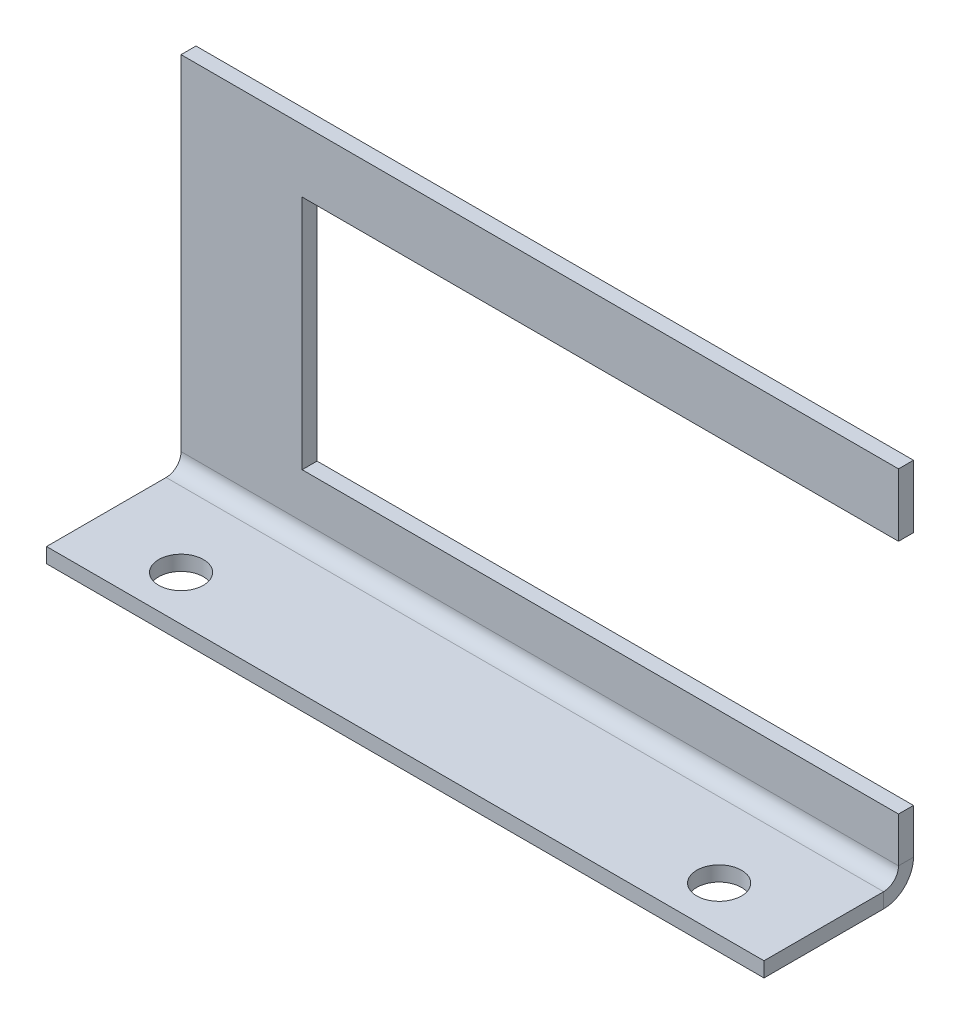
ISO-10303-21;
HEADER;
FILE_DESCRIPTION(('STEP AP214'),'2;1');
FILE_NAME('part.step','',(''),(''),'','','');
FILE_SCHEMA(('AUTOMOTIVE_DESIGN { 1 0 10303 214 1 1 1 1 }'));
ENDSEC;
DATA;
#1=APPLICATION_CONTEXT('core data for automotive mechanical design processes');
#2=APPLICATION_PROTOCOL_DEFINITION('international standard','automotive_design',2000,#1);
#3=PRODUCT_CONTEXT('',#1,'mechanical');
#4=PRODUCT('Part','Part','',(#3));
#5=PRODUCT_RELATED_PRODUCT_CATEGORY('part','',(#4));
#6=PRODUCT_DEFINITION_FORMATION('','',#4);
#7=PRODUCT_DEFINITION_CONTEXT('part definition',#1,'design');
#8=PRODUCT_DEFINITION('design','',#6,#7);
#9=PRODUCT_DEFINITION_SHAPE('','',#8);
#10=(LENGTH_UNIT() NAMED_UNIT(*) SI_UNIT(.MILLI.,.METRE.));
#11=(NAMED_UNIT(*) PLANE_ANGLE_UNIT() SI_UNIT($,.RADIAN.));
#12=(NAMED_UNIT(*) SI_UNIT($,.STERADIAN.) SOLID_ANGLE_UNIT());
#13=UNCERTAINTY_MEASURE_WITH_UNIT(LENGTH_MEASURE(1.E-05),#10,'distance_accuracy_value','');
#14=(GEOMETRIC_REPRESENTATION_CONTEXT(3) GLOBAL_UNCERTAINTY_ASSIGNED_CONTEXT((#13)) GLOBAL_UNIT_ASSIGNED_CONTEXT((#10,
#11,#12)) REPRESENTATION_CONTEXT('',''));
#15=CARTESIAN_POINT('',(0.,0.,0.));
#16=DIRECTION('',(0.,0.,1.));
#17=DIRECTION('',(1.,0.,0.));
#18=AXIS2_PLACEMENT_3D('',#15,#16,#17);
#19=CARTESIAN_POINT('',(60.96,1.27,-11.43));
#20=DIRECTION('',(1.,0.,0.));
#21=DIRECTION('',(0.,-1.,0.));
#22=AXIS2_PLACEMENT_3D('',#19,#20,#21);
#23=PLANE('',#22);
#24=DIRECTION('',(0.,-1.,0.));
#25=VECTOR('',#24,1.);
#26=CARTESIAN_POINT('',(60.96,1.27,-11.43));
#27=LINE('',#26,#25);
#28=CARTESIAN_POINT('',(60.96,31.75,-11.43));
#29=VERTEX_POINT('',#28);
#30=CARTESIAN_POINT('',(60.96,26.416,-11.43));
#31=VERTEX_POINT('',#30);
#32=EDGE_CURVE('E193',#29,#31,#27,.T.);
#33=ORIENTED_EDGE('',*,*,#32,.T.);
#34=DIRECTION('',(0.,0.,-1.));
#35=VECTOR('',#34,1.);
#36=CARTESIAN_POINT('',(60.96,26.416,-12.7));
#37=LINE('',#36,#35);
#38=CARTESIAN_POINT('',(60.96,26.416,-12.7));
#39=VERTEX_POINT('',#38);
#40=EDGE_CURVE('E294',#39,#31,#37,.F.);
#41=ORIENTED_EDGE('',*,*,#40,.F.);
#42=DIRECTION('',(0.,1.,0.));
#43=VECTOR('',#42,1.);
#44=CARTESIAN_POINT('',(60.96,1.27,-12.7));
#45=LINE('',#44,#43);
#46=CARTESIAN_POINT('',(60.96,31.75,-12.7));
#47=VERTEX_POINT('',#46);
#48=EDGE_CURVE('E135',#47,#39,#45,.F.);
#49=ORIENTED_EDGE('',*,*,#48,.F.);
#50=DIRECTION('',(0.,0.,1.));
#51=VECTOR('',#50,1.);
#52=CARTESIAN_POINT('',(60.96,31.75,-11.43));
#53=LINE('',#52,#51);
#54=EDGE_CURVE('E151',#47,#29,#53,.T.);
#55=ORIENTED_EDGE('',*,*,#54,.T.);
#56=EDGE_LOOP('',(#33,#41,#49,#55));
#57=FACE_BOUND('',#56,.T.);
#58=ADVANCED_FACE('F36',(#57),#23,.T.);
#59=CARTESIAN_POINT('',(60.96,6.35,-12.7));
#60=VERTEX_POINT('',#59);
#61=CARTESIAN_POINT('',(60.96,2.54,-12.7));
#62=VERTEX_POINT('',#61);
#63=EDGE_CURVE('E118',#60,#62,#45,.F.);
#64=ORIENTED_EDGE('',*,*,#63,.F.);
#65=DIRECTION('',(0.,0.,-1.));
#66=VECTOR('',#65,1.);
#67=CARTESIAN_POINT('',(60.96,6.35,-12.7));
#68=LINE('',#67,#66);
#69=CARTESIAN_POINT('',(60.96,6.35,-11.43));
#70=VERTEX_POINT('',#69);
#71=EDGE_CURVE('E299',#60,#70,#68,.F.);
#72=ORIENTED_EDGE('',*,*,#71,.T.);
#73=CARTESIAN_POINT('',(60.96,2.54,-11.43));
#74=VERTEX_POINT('',#73);
#75=EDGE_CURVE('E61',#70,#74,#27,.T.);
#76=ORIENTED_EDGE('',*,*,#75,.T.);
#77=DIRECTION('',(0.,0.,1.));
#78=VECTOR('',#77,1.);
#79=CARTESIAN_POINT('',(60.96,2.54,-11.43));
#80=LINE('',#79,#78);
#81=EDGE_CURVE('E154',#62,#74,#80,.T.);
#82=ORIENTED_EDGE('',*,*,#81,.F.);
#83=EDGE_LOOP('',(#64,#72,#76,#82));
#84=FACE_BOUND('',#83,.T.);
#85=ADVANCED_FACE('F242',(#84),#23,.T.);
#86=CARTESIAN_POINT('',(60.96,1.27,-11.43));
#87=DIRECTION('',(0.,0.,-1.));
#88=DIRECTION('',(-1.,0.,0.));
#89=AXIS2_PLACEMENT_3D('',#86,#87,#88);
#90=PLANE('',#89);
#91=DIRECTION('',(-1.,0.,0.));
#92=VECTOR('',#91,1.);
#93=CARTESIAN_POINT('',(10.287,26.416,-11.43));
#94=LINE('',#93,#92);
#95=CARTESIAN_POINT('',(10.287,26.416,-11.43));
#96=VERTEX_POINT('',#95);
#97=EDGE_CURVE('E312',#31,#96,#94,.T.);
#98=ORIENTED_EDGE('',*,*,#97,.F.);
#99=ORIENTED_EDGE('',*,*,#32,.F.);
#100=DIRECTION('',(-1.,0.,0.));
#101=VECTOR('',#100,1.);
#102=CARTESIAN_POINT('',(60.96,31.75,-11.43));
#103=LINE('',#102,#101);
#104=CARTESIAN_POINT('',(0.,31.75,-11.43));
#105=VERTEX_POINT('',#104);
#106=EDGE_CURVE('E196',#29,#105,#103,.T.);
#107=ORIENTED_EDGE('',*,*,#106,.T.);
#108=DIRECTION('',(0.,-1.,0.));
#109=VECTOR('',#108,1.);
#110=CARTESIAN_POINT('',(0.,1.27,-11.43));
#111=LINE('',#110,#109);
#112=CARTESIAN_POINT('',(0.,2.54,-11.43));
#113=VERTEX_POINT('',#112);
#114=EDGE_CURVE('E188',#105,#113,#111,.T.);
#115=ORIENTED_EDGE('',*,*,#114,.T.);
#116=DIRECTION('',(-1.,0.,0.));
#117=VECTOR('',#116,1.);
#118=CARTESIAN_POINT('',(60.96,2.54,-11.43));
#119=LINE('',#118,#117);
#120=EDGE_CURVE('E106',#113,#74,#119,.F.);
#121=ORIENTED_EDGE('',*,*,#120,.T.);
#122=ORIENTED_EDGE('',*,*,#75,.F.);
#123=DIRECTION('',(1.,0.,0.));
#124=VECTOR('',#123,1.);
#125=CARTESIAN_POINT('',(10.287,6.35,-11.43));
#126=LINE('',#125,#124);
#127=CARTESIAN_POINT('',(10.287,6.35,-11.43));
#128=VERTEX_POINT('',#127);
#129=EDGE_CURVE('E319',#128,#70,#126,.T.);
#130=ORIENTED_EDGE('',*,*,#129,.F.);
#131=DIRECTION('',(0.,-1.,0.));
#132=VECTOR('',#131,1.);
#133=CARTESIAN_POINT('',(10.287,26.416,-11.43));
#134=LINE('',#133,#132);
#135=EDGE_CURVE('E52',#96,#128,#134,.T.);
#136=ORIENTED_EDGE('',*,*,#135,.F.);
#137=EDGE_LOOP('',(#98,#99,#107,#115,#121,#122,#130,#136));
#138=FACE_BOUND('',#137,.T.);
#139=ADVANCED_FACE('F210',(#138),#90,.F.);
#140=CARTESIAN_POINT('',(60.96,1.27,-12.7));
#141=DIRECTION('',(0.,0.,-1.));
#142=DIRECTION('',(-1.,0.,0.));
#143=AXIS2_PLACEMENT_3D('',#140,#141,#142);
#144=PLANE('',#143);
#145=ORIENTED_EDGE('',*,*,#48,.T.);
#146=DIRECTION('',(-1.,0.,0.));
#147=VECTOR('',#146,1.);
#148=CARTESIAN_POINT('',(10.287,26.416,-12.7));
#149=LINE('',#148,#147);
#150=CARTESIAN_POINT('',(10.287,26.416,-12.7));
#151=VERTEX_POINT('',#150);
#152=EDGE_CURVE('E314',#39,#151,#149,.T.);
#153=ORIENTED_EDGE('',*,*,#152,.T.);
#154=DIRECTION('',(0.,-1.,0.));
#155=VECTOR('',#154,1.);
#156=CARTESIAN_POINT('',(10.287,26.416,-12.7));
#157=LINE('',#156,#155);
#158=CARTESIAN_POINT('',(10.287,6.35,-12.7));
#159=VERTEX_POINT('',#158);
#160=EDGE_CURVE('E308',#151,#159,#157,.T.);
#161=ORIENTED_EDGE('',*,*,#160,.T.);
#162=DIRECTION('',(1.,0.,0.));
#163=VECTOR('',#162,1.);
#164=CARTESIAN_POINT('',(10.287,6.35,-12.7));
#165=LINE('',#164,#163);
#166=EDGE_CURVE('E311',#159,#60,#165,.T.);
#167=ORIENTED_EDGE('',*,*,#166,.T.);
#168=ORIENTED_EDGE('',*,*,#63,.T.);
#169=DIRECTION('',(-1.,0.,0.));
#170=VECTOR('',#169,1.);
#171=CARTESIAN_POINT('',(60.96,2.54,-12.7));
#172=LINE('',#171,#170);
#173=CARTESIAN_POINT('',(0.,2.54,-12.7));
#174=VERTEX_POINT('',#173);
#175=EDGE_CURVE('E110',#174,#62,#172,.F.);
#176=ORIENTED_EDGE('',*,*,#175,.F.);
#177=DIRECTION('',(0.,1.,0.));
#178=VECTOR('',#177,1.);
#179=CARTESIAN_POINT('',(0.,1.27,-12.7));
#180=LINE('',#179,#178);
#181=CARTESIAN_POINT('',(0.,31.75,-12.7));
#182=VERTEX_POINT('',#181);
#183=EDGE_CURVE('E114',#182,#174,#180,.F.);
#184=ORIENTED_EDGE('',*,*,#183,.F.);
#185=DIRECTION('',(-1.,0.,0.));
#186=VECTOR('',#185,1.);
#187=CARTESIAN_POINT('',(60.96,31.75,-12.7));
#188=LINE('',#187,#186);
#189=EDGE_CURVE('E142',#47,#182,#188,.T.);
#190=ORIENTED_EDGE('',*,*,#189,.F.);
#191=EDGE_LOOP('',(#145,#153,#161,#167,#168,#176,#184,#190));
#192=FACE_BOUND('',#191,.T.);
#193=ADVANCED_FACE('F112',(#192),#144,.T.);
#194=CARTESIAN_POINT('',(0.,1.27,0.));
#195=DIRECTION('',(1.,0.,0.));
#196=DIRECTION('',(0.,0.,1.));
#197=AXIS2_PLACEMENT_3D('',#194,#195,#196);
#198=PLANE('',#197);
#199=DIRECTION('',(0.,1.,0.));
#200=VECTOR('',#199,1.);
#201=CARTESIAN_POINT('',(0.,1.27,-10.16));
#202=LINE('',#201,#200);
#203=CARTESIAN_POINT('',(0.,0.,-10.16));
#204=VERTEX_POINT('',#203);
#205=CARTESIAN_POINT('',(0.,1.27,-10.16));
#206=VERTEX_POINT('',#205);
#207=EDGE_CURVE('E11',#204,#206,#202,.T.);
#208=ORIENTED_EDGE('',*,*,#207,.F.);
#209=DIRECTION('',(0.,0.,-1.));
#210=VECTOR('',#209,1.);
#211=CARTESIAN_POINT('',(0.,0.,0.));
#212=LINE('',#211,#210);
#213=CARTESIAN_POINT('',(0.,0.,0.));
#214=VERTEX_POINT('',#213);
#215=EDGE_CURVE('E144',#204,#214,#212,.F.);
#216=ORIENTED_EDGE('',*,*,#215,.T.);
#217=DIRECTION('',(0.,1.,0.));
#218=VECTOR('',#217,1.);
#219=CARTESIAN_POINT('',(0.,1.27,0.));
#220=LINE('',#219,#218);
#221=CARTESIAN_POINT('',(0.,1.27,0.));
#222=VERTEX_POINT('',#221);
#223=EDGE_CURVE('E45',#214,#222,#220,.T.);
#224=ORIENTED_EDGE('',*,*,#223,.T.);
#225=DIRECTION('',(0.,0.,1.));
#226=VECTOR('',#225,1.);
#227=CARTESIAN_POINT('',(0.,1.27,0.));
#228=LINE('',#227,#226);
#229=EDGE_CURVE('E168',#206,#222,#228,.T.);
#230=ORIENTED_EDGE('',*,*,#229,.F.);
#231=EDGE_LOOP('',(#208,#216,#224,#230));
#232=FACE_BOUND('',#231,.T.);
#233=ADVANCED_FACE('F166',(#232),#198,.F.);
#234=CARTESIAN_POINT('',(60.96,1.27,0.));
#235=DIRECTION('',(0.,0.,1.));
#236=DIRECTION('',(-1.,0.,0.));
#237=AXIS2_PLACEMENT_3D('',#234,#235,#236);
#238=PLANE('',#237);
#239=ORIENTED_EDGE('',*,*,#223,.F.);
#240=DIRECTION('',(1.,0.,0.));
#241=VECTOR('',#240,1.);
#242=CARTESIAN_POINT('',(60.96,0.,0.));
#243=LINE('',#242,#241);
#244=CARTESIAN_POINT('',(60.96,0.,0.));
#245=VERTEX_POINT('',#244);
#246=EDGE_CURVE('E138',#245,#214,#243,.F.);
#247=ORIENTED_EDGE('',*,*,#246,.F.);
#248=DIRECTION('',(0.,1.,0.));
#249=VECTOR('',#248,1.);
#250=CARTESIAN_POINT('',(60.96,1.27,0.));
#251=LINE('',#250,#249);
#252=CARTESIAN_POINT('',(60.96,1.27,0.));
#253=VERTEX_POINT('',#252);
#254=EDGE_CURVE('E159',#245,#253,#251,.T.);
#255=ORIENTED_EDGE('',*,*,#254,.T.);
#256=DIRECTION('',(-1.,0.,0.));
#257=VECTOR('',#256,1.);
#258=CARTESIAN_POINT('',(60.96,1.27,0.));
#259=LINE('',#258,#257);
#260=EDGE_CURVE('E179',#253,#222,#259,.T.);
#261=ORIENTED_EDGE('',*,*,#260,.T.);
#262=EDGE_LOOP('',(#239,#247,#255,#261));
#263=FACE_BOUND('',#262,.T.);
#264=ADVANCED_FACE('F185',(#263),#238,.T.);
#265=CARTESIAN_POINT('',(60.96,1.27,0.));
#266=DIRECTION('',(1.,0.,0.));
#267=DIRECTION('',(0.,0.,1.));
#268=AXIS2_PLACEMENT_3D('',#265,#266,#267);
#269=PLANE('',#268);
#270=ORIENTED_EDGE('',*,*,#254,.F.);
#271=DIRECTION('',(0.,0.,-1.));
#272=VECTOR('',#271,1.);
#273=CARTESIAN_POINT('',(60.96,0.,0.));
#274=LINE('',#273,#272);
#275=CARTESIAN_POINT('',(60.96,0.,-10.16));
#276=VERTEX_POINT('',#275);
#277=EDGE_CURVE('E133',#276,#245,#274,.F.);
#278=ORIENTED_EDGE('',*,*,#277,.F.);
#279=DIRECTION('',(0.,1.,0.));
#280=VECTOR('',#279,1.);
#281=CARTESIAN_POINT('',(60.96,1.27,-10.16));
#282=LINE('',#281,#280);
#283=CARTESIAN_POINT('',(60.96,1.27,-10.16));
#284=VERTEX_POINT('',#283);
#285=EDGE_CURVE('E156',#276,#284,#282,.T.);
#286=ORIENTED_EDGE('',*,*,#285,.T.);
#287=DIRECTION('',(0.,0.,1.));
#288=VECTOR('',#287,1.);
#289=CARTESIAN_POINT('',(60.96,1.27,0.));
#290=LINE('',#289,#288);
#291=EDGE_CURVE('E186',#284,#253,#290,.T.);
#292=ORIENTED_EDGE('',*,*,#291,.T.);
#293=EDGE_LOOP('',(#270,#278,#286,#292));
#294=FACE_BOUND('',#293,.T.);
#295=ADVANCED_FACE('F224',(#294),#269,.T.);
#296=CARTESIAN_POINT('',(60.96,2.54,-10.16));
#297=DIRECTION('',(1.,0.,0.));
#298=DIRECTION('',(0.,0.,-1.));
#299=AXIS2_PLACEMENT_3D('',#296,#297,#298);
#300=PLANE('',#299);
#301=ORIENTED_EDGE('',*,*,#285,.F.);
#302=CARTESIAN_POINT('',(60.96,2.54,-10.16));
#303=DIRECTION('',(1.,0.,0.));
#304=DIRECTION('',(0.,0.,-1.));
#305=AXIS2_PLACEMENT_3D('',#302,#303,#304);
#306=CIRCLE('',#305,2.54);
#307=EDGE_CURVE('E128',#276,#62,#306,.T.);
#308=ORIENTED_EDGE('',*,*,#307,.T.);
#309=ORIENTED_EDGE('',*,*,#81,.T.);
#310=CARTESIAN_POINT('',(60.96,2.54,-10.16));
#311=DIRECTION('',(-1.,0.,0.));
#312=DIRECTION('',(0.,0.,1.));
#313=AXIS2_PLACEMENT_3D('',#310,#311,#312);
#314=CIRCLE('',#313,1.27);
#315=EDGE_CURVE('E183',#284,#74,#314,.F.);
#316=ORIENTED_EDGE('',*,*,#315,.F.);
#317=EDGE_LOOP('',(#301,#308,#309,#316));
#318=FACE_BOUND('',#317,.T.);
#319=ADVANCED_FACE('F225',(#318),#300,.T.);
#320=CARTESIAN_POINT('',(60.96,31.75,-11.43));
#321=DIRECTION('',(0.,-1.,0.));
#322=DIRECTION('',(-1.,0.,0.));
#323=AXIS2_PLACEMENT_3D('',#320,#321,#322);
#324=PLANE('',#323);
#325=ORIENTED_EDGE('',*,*,#54,.F.);
#326=ORIENTED_EDGE('',*,*,#189,.T.);
#327=DIRECTION('',(0.,0.,1.));
#328=VECTOR('',#327,1.);
#329=CARTESIAN_POINT('',(0.,31.75,-11.43));
#330=LINE('',#329,#328);
#331=EDGE_CURVE('E105',#182,#105,#330,.T.);
#332=ORIENTED_EDGE('',*,*,#331,.T.);
#333=ORIENTED_EDGE('',*,*,#106,.F.);
#334=EDGE_LOOP('',(#325,#326,#332,#333));
#335=FACE_BOUND('',#334,.T.);
#336=ADVANCED_FACE('F250',(#335),#324,.F.);
#337=CARTESIAN_POINT('',(0.,1.27,-11.43));
#338=DIRECTION('',(1.,0.,0.));
#339=DIRECTION('',(0.,-1.,0.));
#340=AXIS2_PLACEMENT_3D('',#337,#338,#339);
#341=PLANE('',#340);
#342=ORIENTED_EDGE('',*,*,#331,.F.);
#343=ORIENTED_EDGE('',*,*,#183,.T.);
#344=DIRECTION('',(0.,0.,1.));
#345=VECTOR('',#344,1.);
#346=CARTESIAN_POINT('',(0.,2.54,-11.43));
#347=LINE('',#346,#345);
#348=EDGE_CURVE('E40',#174,#113,#347,.T.);
#349=ORIENTED_EDGE('',*,*,#348,.T.);
#350=ORIENTED_EDGE('',*,*,#114,.F.);
#351=EDGE_LOOP('',(#342,#343,#349,#350));
#352=FACE_BOUND('',#351,.T.);
#353=ADVANCED_FACE('F131',(#352),#341,.F.);
#354=CARTESIAN_POINT('',(0.,2.54,-10.16));
#355=DIRECTION('',(-1.,0.,0.));
#356=DIRECTION('',(0.,0.,1.));
#357=AXIS2_PLACEMENT_3D('',#354,#355,#356);
#358=PLANE('',#357);
#359=CARTESIAN_POINT('',(0.,2.54,-10.16));
#360=DIRECTION('',(1.,0.,0.));
#361=DIRECTION('',(0.,0.,-1.));
#362=AXIS2_PLACEMENT_3D('',#359,#360,#361);
#363=CIRCLE('',#362,2.54);
#364=EDGE_CURVE('E97',#174,#204,#363,.F.);
#365=ORIENTED_EDGE('',*,*,#364,.T.);
#366=ORIENTED_EDGE('',*,*,#207,.T.);
#367=CARTESIAN_POINT('',(0.,2.54,-10.16));
#368=DIRECTION('',(1.,0.,0.));
#369=DIRECTION('',(0.,0.,-1.));
#370=AXIS2_PLACEMENT_3D('',#367,#368,#369);
#371=CIRCLE('',#370,1.27);
#372=EDGE_CURVE('E99',#113,#206,#371,.F.);
#373=ORIENTED_EDGE('',*,*,#372,.F.);
#374=ORIENTED_EDGE('',*,*,#348,.F.);
#375=EDGE_LOOP('',(#365,#366,#373,#374));
#376=FACE_BOUND('',#375,.T.);
#377=ADVANCED_FACE('F38',(#376),#358,.T.);
#378=CARTESIAN_POINT('',(60.96,1.27,0.));
#379=DIRECTION('',(0.,-1.,0.));
#380=DIRECTION('',(0.,0.,-1.));
#381=AXIS2_PLACEMENT_3D('',#378,#379,#380);
#382=PLANE('',#381);
#383=CARTESIAN_POINT('',(53.34,1.27,-3.81));
#384=DIRECTION('',(0.,1.,0.));
#385=DIRECTION('',(0.,0.,1.));
#386=AXIS2_PLACEMENT_3D('',#383,#384,#385);
#387=CIRCLE('',#386,1.89865);
#388=CARTESIAN_POINT('',(53.34,1.27,-1.91135));
#389=VERTEX_POINT('',#388);
#390=EDGE_CURVE('E293',#389,#389,#387,.T.);
#391=ORIENTED_EDGE('',*,*,#390,.F.);
#392=EDGE_LOOP('',(#391));
#393=FACE_BOUND('',#392,.T.);
#394=CARTESIAN_POINT('',(7.62,1.27,-3.81));
#395=DIRECTION('',(0.,1.,0.));
#396=DIRECTION('',(0.,0.,1.));
#397=AXIS2_PLACEMENT_3D('',#394,#395,#396);
#398=CIRCLE('',#397,1.89865);
#399=CARTESIAN_POINT('',(7.62,1.27,-1.91135));
#400=VERTEX_POINT('',#399);
#401=EDGE_CURVE('E296',#400,#400,#398,.T.);
#402=ORIENTED_EDGE('',*,*,#401,.F.);
#403=EDGE_LOOP('',(#402));
#404=FACE_BOUND('',#403,.T.);
#405=ORIENTED_EDGE('',*,*,#291,.F.);
#406=DIRECTION('',(-1.,0.,0.));
#407=VECTOR('',#406,1.);
#408=CARTESIAN_POINT('',(0.,1.27,-10.16));
#409=LINE('',#408,#407);
#410=EDGE_CURVE('E182',#284,#206,#409,.T.);
#411=ORIENTED_EDGE('',*,*,#410,.T.);
#412=ORIENTED_EDGE('',*,*,#229,.T.);
#413=ORIENTED_EDGE('',*,*,#260,.F.);
#414=EDGE_LOOP('',(#405,#411,#412,#413));
#415=FACE_BOUND('',#414,.T.);
#416=ADVANCED_FACE('F178',(#393,#404,#415),#382,.F.);
#417=CARTESIAN_POINT('',(60.96,2.54,-10.16));
#418=DIRECTION('',(1.,0.,0.));
#419=DIRECTION('',(0.,0.,-1.));
#420=AXIS2_PLACEMENT_3D('',#417,#418,#419);
#421=CYLINDRICAL_SURFACE('',#420,1.27);
#422=ORIENTED_EDGE('',*,*,#315,.T.);
#423=ORIENTED_EDGE('',*,*,#120,.F.);
#424=ORIENTED_EDGE('',*,*,#372,.T.);
#425=ORIENTED_EDGE('',*,*,#410,.F.);
#426=EDGE_LOOP('',(#422,#423,#424,#425));
#427=FACE_BOUND('',#426,.T.);
#428=ADVANCED_FACE('F206',(#427),#421,.F.);
#429=CARTESIAN_POINT('',(60.96,0.,0.));
#430=DIRECTION('',(0.,-1.,0.));
#431=DIRECTION('',(0.,0.,-1.));
#432=AXIS2_PLACEMENT_3D('',#429,#430,#431);
#433=PLANE('',#432);
#434=CARTESIAN_POINT('',(53.34,0.,-3.81));
#435=DIRECTION('',(0.,1.,0.));
#436=DIRECTION('',(0.,0.,1.));
#437=AXIS2_PLACEMENT_3D('',#434,#435,#436);
#438=CIRCLE('',#437,1.89865);
#439=CARTESIAN_POINT('',(53.34,0.,-1.91135));
#440=VERTEX_POINT('',#439);
#441=EDGE_CURVE('E290',#440,#440,#438,.T.);
#442=ORIENTED_EDGE('',*,*,#441,.T.);
#443=EDGE_LOOP('',(#442));
#444=FACE_BOUND('',#443,.T.);
#445=CARTESIAN_POINT('',(7.62,0.,-3.81));
#446=DIRECTION('',(0.,1.,0.));
#447=DIRECTION('',(0.,0.,1.));
#448=AXIS2_PLACEMENT_3D('',#445,#446,#447);
#449=CIRCLE('',#448,1.89865);
#450=CARTESIAN_POINT('',(7.62,0.,-1.91135));
#451=VERTEX_POINT('',#450);
#452=EDGE_CURVE('E303',#451,#451,#449,.T.);
#453=ORIENTED_EDGE('',*,*,#452,.T.);
#454=EDGE_LOOP('',(#453));
#455=FACE_BOUND('',#454,.T.);
#456=ORIENTED_EDGE('',*,*,#277,.T.);
#457=ORIENTED_EDGE('',*,*,#246,.T.);
#458=ORIENTED_EDGE('',*,*,#215,.F.);
#459=DIRECTION('',(1.,0.,0.));
#460=VECTOR('',#459,1.);
#461=CARTESIAN_POINT('',(60.96,0.,-10.16));
#462=LINE('',#461,#460);
#463=EDGE_CURVE('E122',#276,#204,#462,.F.);
#464=ORIENTED_EDGE('',*,*,#463,.F.);
#465=EDGE_LOOP('',(#456,#457,#458,#464));
#466=FACE_BOUND('',#465,.T.);
#467=ADVANCED_FACE('F227',(#444,#455,#466),#433,.T.);
#468=CARTESIAN_POINT('',(60.96,2.54,-10.16));
#469=DIRECTION('',(1.,0.,0.));
#470=DIRECTION('',(0.,0.,-1.));
#471=AXIS2_PLACEMENT_3D('',#468,#469,#470);
#472=CYLINDRICAL_SURFACE('',#471,2.54);
#473=ORIENTED_EDGE('',*,*,#307,.F.);
#474=ORIENTED_EDGE('',*,*,#463,.T.);
#475=ORIENTED_EDGE('',*,*,#364,.F.);
#476=ORIENTED_EDGE('',*,*,#175,.T.);
#477=EDGE_LOOP('',(#473,#474,#475,#476));
#478=FACE_BOUND('',#477,.T.);
#479=ADVANCED_FACE('F125',(#478),#472,.T.);
#480=CARTESIAN_POINT('',(10.287,26.416,-12.7));
#481=DIRECTION('',(-1.,0.,0.));
#482=DIRECTION('',(0.,-1.,0.));
#483=AXIS2_PLACEMENT_3D('',#480,#481,#482);
#484=PLANE('',#483);
#485=ORIENTED_EDGE('',*,*,#135,.T.);
#486=DIRECTION('',(0.,0.,1.));
#487=VECTOR('',#486,1.);
#488=CARTESIAN_POINT('',(10.287,6.35,-12.7));
#489=LINE('',#488,#487);
#490=EDGE_CURVE('E317',#159,#128,#489,.T.);
#491=ORIENTED_EDGE('',*,*,#490,.F.);
#492=ORIENTED_EDGE('',*,*,#160,.F.);
#493=DIRECTION('',(0.,0.,1.));
#494=VECTOR('',#493,1.);
#495=CARTESIAN_POINT('',(10.287,26.416,-12.7));
#496=LINE('',#495,#494);
#497=EDGE_CURVE('E129',#151,#96,#496,.T.);
#498=ORIENTED_EDGE('',*,*,#497,.T.);
#499=EDGE_LOOP('',(#485,#491,#492,#498));
#500=FACE_BOUND('',#499,.T.);
#501=ADVANCED_FACE('F235',(#500),#484,.F.);
#502=CARTESIAN_POINT('',(10.287,26.416,-12.7));
#503=DIRECTION('',(0.,1.,0.));
#504=DIRECTION('',(-1.,0.,0.));
#505=AXIS2_PLACEMENT_3D('',#502,#503,#504);
#506=PLANE('',#505);
#507=ORIENTED_EDGE('',*,*,#97,.T.);
#508=ORIENTED_EDGE('',*,*,#497,.F.);
#509=ORIENTED_EDGE('',*,*,#152,.F.);
#510=ORIENTED_EDGE('',*,*,#40,.T.);
#511=EDGE_LOOP('',(#507,#508,#509,#510));
#512=FACE_BOUND('',#511,.T.);
#513=ADVANCED_FACE('F271',(#512),#506,.F.);
#514=CARTESIAN_POINT('',(10.287,6.35,-12.7));
#515=DIRECTION('',(0.,-1.,0.));
#516=DIRECTION('',(0.,0.,-1.));
#517=AXIS2_PLACEMENT_3D('',#514,#515,#516);
#518=PLANE('',#517);
#519=ORIENTED_EDGE('',*,*,#129,.T.);
#520=ORIENTED_EDGE('',*,*,#71,.F.);
#521=ORIENTED_EDGE('',*,*,#166,.F.);
#522=ORIENTED_EDGE('',*,*,#490,.T.);
#523=EDGE_LOOP('',(#519,#520,#521,#522));
#524=FACE_BOUND('',#523,.T.);
#525=ADVANCED_FACE('F272',(#524),#518,.F.);
#526=CARTESIAN_POINT('',(7.62,0.,-3.81));
#527=DIRECTION('',(0.,1.,0.));
#528=DIRECTION('',(0.,0.,1.));
#529=AXIS2_PLACEMENT_3D('',#526,#527,#528);
#530=CYLINDRICAL_SURFACE('',#529,1.89865);
#531=ORIENTED_EDGE('',*,*,#452,.F.);
#532=EDGE_LOOP('',(#531));
#533=FACE_BOUND('',#532,.T.);
#534=ORIENTED_EDGE('',*,*,#401,.T.);
#535=EDGE_LOOP('',(#534));
#536=FACE_BOUND('',#535,.T.);
#537=ADVANCED_FACE('F275',(#533,#536),#530,.F.);
#538=CARTESIAN_POINT('',(53.34,0.,-3.81));
#539=DIRECTION('',(0.,1.,0.));
#540=DIRECTION('',(0.,0.,1.));
#541=AXIS2_PLACEMENT_3D('',#538,#539,#540);
#542=CYLINDRICAL_SURFACE('',#541,1.89865);
#543=ORIENTED_EDGE('',*,*,#441,.F.);
#544=EDGE_LOOP('',(#543));
#545=FACE_BOUND('',#544,.T.);
#546=ORIENTED_EDGE('',*,*,#390,.T.);
#547=EDGE_LOOP('',(#546));
#548=FACE_BOUND('',#547,.T.);
#549=ADVANCED_FACE('F282',(#545,#548),#542,.F.);
#550=CLOSED_SHELL('',(#58,#85,#139,#193,#233,#264,#295,#319,#336,#353,#377,#416,#428,#467,#479,
#501,#513,#525,#537,#549));
#551=MANIFOLD_SOLID_BREP('B2',#550);
#552=ADVANCED_BREP_SHAPE_REPRESENTATION('',(#18,#551),#14);
#553=SHAPE_DEFINITION_REPRESENTATION(#9,#552);
ENDSEC;
END-ISO-10303-21;
